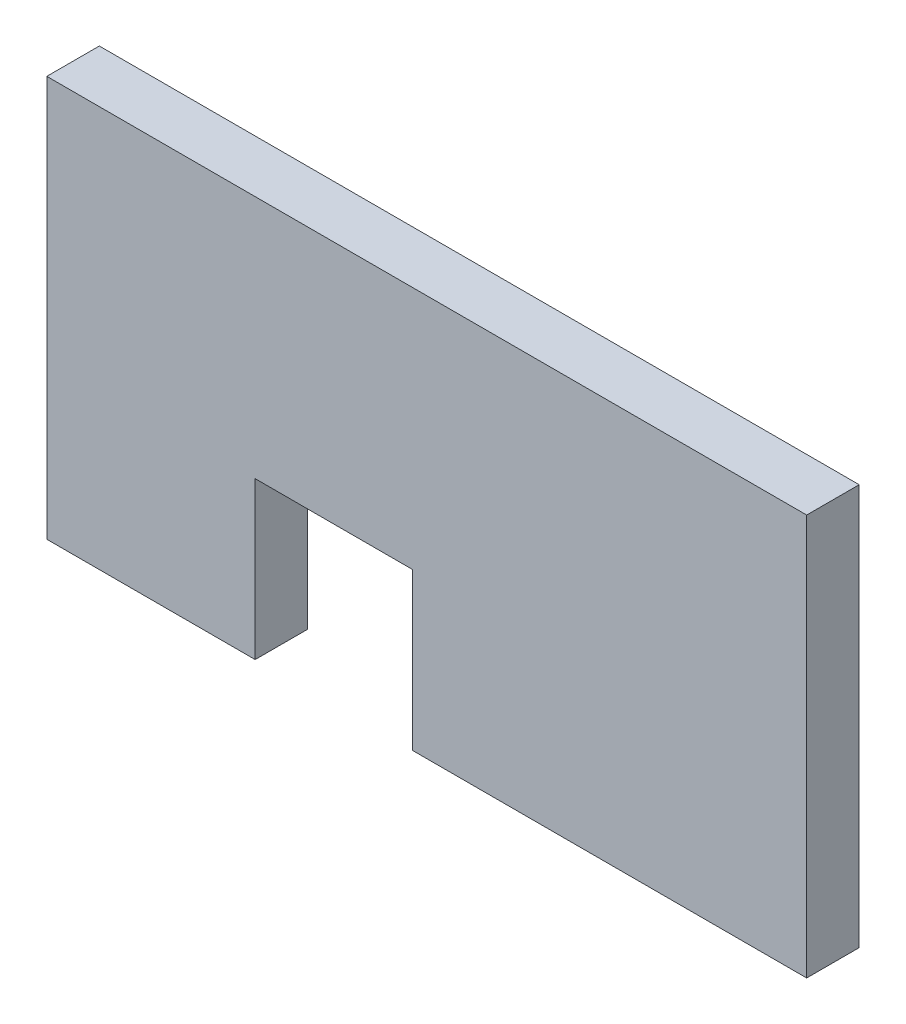
ISO-10303-21;
HEADER;
FILE_DESCRIPTION(('STEP AP214'),'2;1');
FILE_NAME('part.step','',(''),(''),'','','');
FILE_SCHEMA(('AUTOMOTIVE_DESIGN { 1 0 10303 214 1 1 1 1 }'));
ENDSEC;
DATA;
#1=APPLICATION_CONTEXT('core data for automotive mechanical design processes');
#2=APPLICATION_PROTOCOL_DEFINITION('international standard','automotive_design',2000,#1);
#3=PRODUCT_CONTEXT('',#1,'mechanical');
#4=PRODUCT('Part','Part','',(#3));
#5=PRODUCT_RELATED_PRODUCT_CATEGORY('part','',(#4));
#6=PRODUCT_DEFINITION_FORMATION('','',#4);
#7=PRODUCT_DEFINITION_CONTEXT('part definition',#1,'design');
#8=PRODUCT_DEFINITION('design','',#6,#7);
#9=PRODUCT_DEFINITION_SHAPE('','',#8);
#10=(LENGTH_UNIT() NAMED_UNIT(*) SI_UNIT(.MILLI.,.METRE.));
#11=(NAMED_UNIT(*) PLANE_ANGLE_UNIT() SI_UNIT($,.RADIAN.));
#12=(NAMED_UNIT(*) SI_UNIT($,.STERADIAN.) SOLID_ANGLE_UNIT());
#13=UNCERTAINTY_MEASURE_WITH_UNIT(LENGTH_MEASURE(1.E-05),#10,'distance_accuracy_value','');
#14=(GEOMETRIC_REPRESENTATION_CONTEXT(3) GLOBAL_UNCERTAINTY_ASSIGNED_CONTEXT((#13)) GLOBAL_UNIT_ASSIGNED_CONTEXT((#10,
#11,#12)) REPRESENTATION_CONTEXT('',''));
#15=CARTESIAN_POINT('',(0.,0.,0.));
#16=DIRECTION('',(0.,0.,1.));
#17=DIRECTION('',(1.,0.,0.));
#18=AXIS2_PLACEMENT_3D('',#15,#16,#17);
#19=CARTESIAN_POINT('',(21.7,37.95,-2.99999999999997));
#20=DIRECTION('',(-1.,0.,0.));
#21=DIRECTION('',(0.,-1.,0.));
#22=AXIS2_PLACEMENT_3D('',#19,#20,#21);
#23=PLANE('',#22);
#24=DIRECTION('',(0.,1.,0.));
#25=VECTOR('',#24,1.);
#26=CARTESIAN_POINT('',(21.7,37.95,0.));
#27=LINE('',#26,#25);
#28=CARTESIAN_POINT('',(21.7,15.05,0.));
#29=VERTEX_POINT('',#28);
#30=CARTESIAN_POINT('',(21.7,37.95,0.));
#31=VERTEX_POINT('',#30);
#32=EDGE_CURVE('E129',#29,#31,#27,.T.);
#33=ORIENTED_EDGE('',*,*,#32,.F.);
#34=DIRECTION('',(0.,0.,1.));
#35=VECTOR('',#34,1.);
#36=CARTESIAN_POINT('',(21.7,15.05,-2.99999999999997));
#37=LINE('',#36,#35);
#38=CARTESIAN_POINT('',(21.7,15.05,-2.99999999999997));
#39=VERTEX_POINT('',#38);
#40=EDGE_CURVE('E128',#39,#29,#37,.T.);
#41=ORIENTED_EDGE('',*,*,#40,.F.);
#42=DIRECTION('',(0.,1.,0.));
#43=VECTOR('',#42,1.);
#44=CARTESIAN_POINT('',(21.7,37.95,-2.99999999999997));
#45=LINE('',#44,#43);
#46=CARTESIAN_POINT('',(21.7,37.95,-2.99999999999997));
#47=VERTEX_POINT('',#46);
#48=EDGE_CURVE('E147',#39,#47,#45,.T.);
#49=ORIENTED_EDGE('',*,*,#48,.T.);
#50=DIRECTION('',(0.,0.,1.));
#51=VECTOR('',#50,1.);
#52=CARTESIAN_POINT('',(21.7,37.95,-2.99999999999997));
#53=LINE('',#52,#51);
#54=EDGE_CURVE('E11',#47,#31,#53,.T.);
#55=ORIENTED_EDGE('',*,*,#54,.T.);
#56=EDGE_LOOP('',(#33,#41,#49,#55));
#57=FACE_BOUND('',#56,.T.);
#58=ADVANCED_FACE('F33',(#57),#23,.F.);
#59=CARTESIAN_POINT('',(21.7,37.95,-2.99999999999997));
#60=DIRECTION('',(0.,-1.,0.));
#61=DIRECTION('',(1.,0.,0.));
#62=AXIS2_PLACEMENT_3D('',#59,#60,#61);
#63=PLANE('',#62);
#64=DIRECTION('',(-1.,0.,0.));
#65=VECTOR('',#64,1.);
#66=CARTESIAN_POINT('',(21.7,37.95,0.));
#67=LINE('',#66,#65);
#68=CARTESIAN_POINT('',(-21.7,37.95,0.));
#69=VERTEX_POINT('',#68);
#70=EDGE_CURVE('E131',#31,#69,#67,.T.);
#71=ORIENTED_EDGE('',*,*,#70,.F.);
#72=ORIENTED_EDGE('',*,*,#54,.F.);
#73=DIRECTION('',(-1.,0.,0.));
#74=VECTOR('',#73,1.);
#75=CARTESIAN_POINT('',(21.7,37.95,-2.99999999999997));
#76=LINE('',#75,#74);
#77=CARTESIAN_POINT('',(-21.7,37.95,-2.99999999999997));
#78=VERTEX_POINT('',#77);
#79=EDGE_CURVE('E87',#47,#78,#76,.T.);
#80=ORIENTED_EDGE('',*,*,#79,.T.);
#81=DIRECTION('',(0.,0.,1.));
#82=VECTOR('',#81,1.);
#83=CARTESIAN_POINT('',(-21.7,37.95,-2.99999999999997));
#84=LINE('',#83,#82);
#85=EDGE_CURVE('E41',#78,#69,#84,.T.);
#86=ORIENTED_EDGE('',*,*,#85,.T.);
#87=EDGE_LOOP('',(#71,#72,#80,#86));
#88=FACE_BOUND('',#87,.T.);
#89=ADVANCED_FACE('F159',(#88),#63,.F.);
#90=CARTESIAN_POINT('',(-21.7,37.95,-2.99999999999997));
#91=DIRECTION('',(1.,0.,0.));
#92=DIRECTION('',(0.,1.,0.));
#93=AXIS2_PLACEMENT_3D('',#90,#91,#92);
#94=PLANE('',#93);
#95=DIRECTION('',(0.,-1.,0.));
#96=VECTOR('',#95,1.);
#97=CARTESIAN_POINT('',(-21.7,37.95,0.));
#98=LINE('',#97,#96);
#99=CARTESIAN_POINT('',(-21.7,15.05,0.));
#100=VERTEX_POINT('',#99);
#101=EDGE_CURVE('E134',#69,#100,#98,.T.);
#102=ORIENTED_EDGE('',*,*,#101,.F.);
#103=ORIENTED_EDGE('',*,*,#85,.F.);
#104=DIRECTION('',(0.,-1.,0.));
#105=VECTOR('',#104,1.);
#106=CARTESIAN_POINT('',(-21.7,37.95,-2.99999999999997));
#107=LINE('',#106,#105);
#108=CARTESIAN_POINT('',(-21.7,15.05,-2.99999999999997));
#109=VERTEX_POINT('',#108);
#110=EDGE_CURVE('E168',#78,#109,#107,.T.);
#111=ORIENTED_EDGE('',*,*,#110,.T.);
#112=DIRECTION('',(0.,0.,1.));
#113=VECTOR('',#112,1.);
#114=CARTESIAN_POINT('',(-21.7,15.05,-2.99999999999997));
#115=LINE('',#114,#113);
#116=EDGE_CURVE('E154',#109,#100,#115,.T.);
#117=ORIENTED_EDGE('',*,*,#116,.T.);
#118=EDGE_LOOP('',(#102,#103,#111,#117));
#119=FACE_BOUND('',#118,.T.);
#120=ADVANCED_FACE('F178',(#119),#94,.F.);
#121=CARTESIAN_POINT('',(-9.79999999999998,15.05,-2.99999999999997));
#122=DIRECTION('',(0.,1.,0.));
#123=DIRECTION('',(-1.,0.,0.));
#124=AXIS2_PLACEMENT_3D('',#121,#122,#123);
#125=PLANE('',#124);
#126=DIRECTION('',(1.,0.,0.));
#127=VECTOR('',#126,1.);
#128=CARTESIAN_POINT('',(-9.79999999999998,15.05,0.));
#129=LINE('',#128,#127);
#130=CARTESIAN_POINT('',(-9.79999999999998,15.05,0.));
#131=VERTEX_POINT('',#130);
#132=EDGE_CURVE('E137',#100,#131,#129,.T.);
#133=ORIENTED_EDGE('',*,*,#132,.F.);
#134=ORIENTED_EDGE('',*,*,#116,.F.);
#135=DIRECTION('',(1.,0.,0.));
#136=VECTOR('',#135,1.);
#137=CARTESIAN_POINT('',(-9.79999999999998,15.05,-2.99999999999997));
#138=LINE('',#137,#136);
#139=CARTESIAN_POINT('',(-9.79999999999998,15.05,-2.99999999999997));
#140=VERTEX_POINT('',#139);
#141=EDGE_CURVE('E123',#109,#140,#138,.T.);
#142=ORIENTED_EDGE('',*,*,#141,.T.);
#143=DIRECTION('',(0.,0.,1.));
#144=VECTOR('',#143,1.);
#145=CARTESIAN_POINT('',(-9.79999999999998,15.05,-2.99999999999997));
#146=LINE('',#145,#144);
#147=EDGE_CURVE('E151',#140,#131,#146,.T.);
#148=ORIENTED_EDGE('',*,*,#147,.T.);
#149=EDGE_LOOP('',(#133,#134,#142,#148));
#150=FACE_BOUND('',#149,.T.);
#151=ADVANCED_FACE('F174',(#150),#125,.F.);
#152=CARTESIAN_POINT('',(-9.79999999999998,24.,-2.99999999999997));
#153=DIRECTION('',(-1.,0.,0.));
#154=DIRECTION('',(0.,0.,-1.));
#155=AXIS2_PLACEMENT_3D('',#152,#153,#154);
#156=PLANE('',#155);
#157=DIRECTION('',(0.,1.,0.));
#158=VECTOR('',#157,1.);
#159=CARTESIAN_POINT('',(-9.79999999999998,24.,0.));
#160=LINE('',#159,#158);
#161=CARTESIAN_POINT('',(-9.79999999999998,24.,0.));
#162=VERTEX_POINT('',#161);
#163=EDGE_CURVE('E140',#131,#162,#160,.T.);
#164=ORIENTED_EDGE('',*,*,#163,.F.);
#165=ORIENTED_EDGE('',*,*,#147,.F.);
#166=DIRECTION('',(0.,1.,0.));
#167=VECTOR('',#166,1.);
#168=CARTESIAN_POINT('',(-9.79999999999998,24.,-2.99999999999997));
#169=LINE('',#168,#167);
#170=CARTESIAN_POINT('',(-9.79999999999998,24.,-2.99999999999997));
#171=VERTEX_POINT('',#170);
#172=EDGE_CURVE('E121',#140,#171,#169,.T.);
#173=ORIENTED_EDGE('',*,*,#172,.T.);
#174=DIRECTION('',(0.,0.,1.));
#175=VECTOR('',#174,1.);
#176=CARTESIAN_POINT('',(-9.79999999999998,24.,-2.99999999999997));
#177=LINE('',#176,#175);
#178=EDGE_CURVE('E115',#171,#162,#177,.T.);
#179=ORIENTED_EDGE('',*,*,#178,.T.);
#180=EDGE_LOOP('',(#164,#165,#173,#179));
#181=FACE_BOUND('',#180,.T.);
#182=ADVANCED_FACE('F177',(#181),#156,.F.);
#183=CARTESIAN_POINT('',(-0.799999999999969,24.,-2.99999999999997));
#184=DIRECTION('',(0.,1.,0.));
#185=DIRECTION('',(0.,0.,-1.));
#186=AXIS2_PLACEMENT_3D('',#183,#184,#185);
#187=PLANE('',#186);
#188=DIRECTION('',(1.,0.,0.));
#189=VECTOR('',#188,1.);
#190=CARTESIAN_POINT('',(-0.799999999999969,24.,0.));
#191=LINE('',#190,#189);
#192=CARTESIAN_POINT('',(-0.799999999999969,24.,0.));
#193=VERTEX_POINT('',#192);
#194=EDGE_CURVE('E143',#162,#193,#191,.T.);
#195=ORIENTED_EDGE('',*,*,#194,.F.);
#196=ORIENTED_EDGE('',*,*,#178,.F.);
#197=DIRECTION('',(1.,0.,0.));
#198=VECTOR('',#197,1.);
#199=CARTESIAN_POINT('',(-0.799999999999969,24.,-2.99999999999997));
#200=LINE('',#199,#198);
#201=CARTESIAN_POINT('',(-0.799999999999969,24.,-2.99999999999997));
#202=VERTEX_POINT('',#201);
#203=EDGE_CURVE('E105',#171,#202,#200,.T.);
#204=ORIENTED_EDGE('',*,*,#203,.T.);
#205=DIRECTION('',(0.,0.,1.));
#206=VECTOR('',#205,1.);
#207=CARTESIAN_POINT('',(-0.799999999999969,24.,-2.99999999999997));
#208=LINE('',#207,#206);
#209=EDGE_CURVE('E110',#202,#193,#208,.T.);
#210=ORIENTED_EDGE('',*,*,#209,.T.);
#211=EDGE_LOOP('',(#195,#196,#204,#210));
#212=FACE_BOUND('',#211,.T.);
#213=ADVANCED_FACE('F118',(#212),#187,.F.);
#214=CARTESIAN_POINT('',(-0.799999999999969,15.05,-2.99999999999997));
#215=DIRECTION('',(1.,0.,0.));
#216=DIRECTION('',(0.,1.,0.));
#217=AXIS2_PLACEMENT_3D('',#214,#215,#216);
#218=PLANE('',#217);
#219=DIRECTION('',(0.,-1.,0.));
#220=VECTOR('',#219,1.);
#221=CARTESIAN_POINT('',(-0.799999999999969,15.05,0.));
#222=LINE('',#221,#220);
#223=CARTESIAN_POINT('',(-0.799999999999969,15.05,0.));
#224=VERTEX_POINT('',#223);
#225=EDGE_CURVE('E112',#193,#224,#222,.T.);
#226=ORIENTED_EDGE('',*,*,#225,.F.);
#227=ORIENTED_EDGE('',*,*,#209,.F.);
#228=DIRECTION('',(0.,-1.,0.));
#229=VECTOR('',#228,1.);
#230=CARTESIAN_POINT('',(-0.799999999999969,15.05,-2.99999999999997));
#231=LINE('',#230,#229);
#232=CARTESIAN_POINT('',(-0.799999999999969,15.05,-2.99999999999997));
#233=VERTEX_POINT('',#232);
#234=EDGE_CURVE('E101',#202,#233,#231,.T.);
#235=ORIENTED_EDGE('',*,*,#234,.T.);
#236=DIRECTION('',(0.,0.,1.));
#237=VECTOR('',#236,1.);
#238=CARTESIAN_POINT('',(-0.799999999999969,15.05,-2.99999999999997));
#239=LINE('',#238,#237);
#240=EDGE_CURVE('E116',#233,#224,#239,.T.);
#241=ORIENTED_EDGE('',*,*,#240,.T.);
#242=EDGE_LOOP('',(#226,#227,#235,#241));
#243=FACE_BOUND('',#242,.T.);
#244=ADVANCED_FACE('F111',(#243),#218,.F.);
#245=CARTESIAN_POINT('',(21.7,15.05,-2.99999999999997));
#246=DIRECTION('',(0.,1.,0.));
#247=DIRECTION('',(0.,0.,-1.));
#248=AXIS2_PLACEMENT_3D('',#245,#246,#247);
#249=PLANE('',#248);
#250=DIRECTION('',(1.,0.,0.));
#251=VECTOR('',#250,1.);
#252=CARTESIAN_POINT('',(21.7,15.05,0.));
#253=LINE('',#252,#251);
#254=EDGE_CURVE('E75',#224,#29,#253,.T.);
#255=ORIENTED_EDGE('',*,*,#254,.F.);
#256=ORIENTED_EDGE('',*,*,#240,.F.);
#257=DIRECTION('',(1.,0.,0.));
#258=VECTOR('',#257,1.);
#259=CARTESIAN_POINT('',(21.7,15.05,-2.99999999999997));
#260=LINE('',#259,#258);
#261=EDGE_CURVE('E49',#233,#39,#260,.T.);
#262=ORIENTED_EDGE('',*,*,#261,.T.);
#263=ORIENTED_EDGE('',*,*,#40,.T.);
#264=EDGE_LOOP('',(#255,#256,#262,#263));
#265=FACE_BOUND('',#264,.T.);
#266=ADVANCED_FACE('F228',(#265),#249,.F.);
#267=CARTESIAN_POINT('',(0.,0.,-2.99999999999997));
#268=DIRECTION('',(0.,0.,1.));
#269=DIRECTION('',(-1.,0.,0.));
#270=AXIS2_PLACEMENT_3D('',#267,#268,#269);
#271=PLANE('',#270);
#272=ORIENTED_EDGE('',*,*,#48,.F.);
#273=ORIENTED_EDGE('',*,*,#261,.F.);
#274=ORIENTED_EDGE('',*,*,#234,.F.);
#275=ORIENTED_EDGE('',*,*,#203,.F.);
#276=ORIENTED_EDGE('',*,*,#172,.F.);
#277=ORIENTED_EDGE('',*,*,#141,.F.);
#278=ORIENTED_EDGE('',*,*,#110,.F.);
#279=ORIENTED_EDGE('',*,*,#79,.F.);
#280=EDGE_LOOP('',(#272,#273,#274,#275,#276,#277,#278,#279));
#281=FACE_BOUND('',#280,.T.);
#282=ADVANCED_FACE('F103',(#281),#271,.F.);
#283=CARTESIAN_POINT('',(0.,0.,0.));
#284=DIRECTION('',(0.,0.,1.));
#285=DIRECTION('',(-1.,0.,0.));
#286=AXIS2_PLACEMENT_3D('',#283,#284,#285);
#287=PLANE('',#286);
#288=ORIENTED_EDGE('',*,*,#32,.T.);
#289=ORIENTED_EDGE('',*,*,#70,.T.);
#290=ORIENTED_EDGE('',*,*,#101,.T.);
#291=ORIENTED_EDGE('',*,*,#132,.T.);
#292=ORIENTED_EDGE('',*,*,#163,.T.);
#293=ORIENTED_EDGE('',*,*,#194,.T.);
#294=ORIENTED_EDGE('',*,*,#225,.T.);
#295=ORIENTED_EDGE('',*,*,#254,.T.);
#296=EDGE_LOOP('',(#288,#289,#290,#291,#292,#293,#294,#295));
#297=FACE_BOUND('',#296,.T.);
#298=ADVANCED_FACE('F162',(#297),#287,.T.);
#299=CLOSED_SHELL('',(#58,#89,#120,#151,#182,#213,#244,#266,#282,#298));
#300=MANIFOLD_SOLID_BREP('B2',#299);
#301=ADVANCED_BREP_SHAPE_REPRESENTATION('',(#18,#300),#14);
#302=SHAPE_DEFINITION_REPRESENTATION(#9,#301);
ENDSEC;
END-ISO-10303-21;
